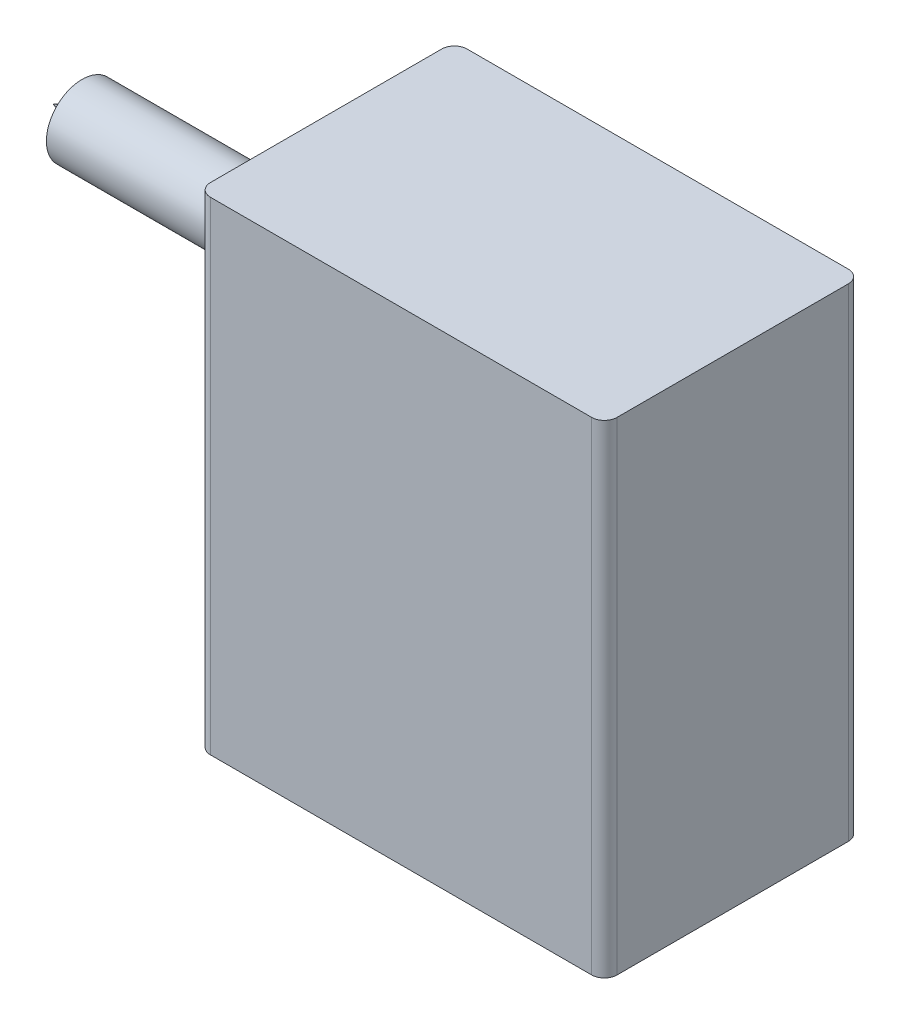
ISO-10303-21;
HEADER;
FILE_DESCRIPTION(('STEP AP214'),'2;1');
FILE_NAME('part.step','',(''),(''),'','','');
FILE_SCHEMA(('AUTOMOTIVE_DESIGN { 1 0 10303 214 1 1 1 1 }'));
ENDSEC;
DATA;
#1=APPLICATION_CONTEXT('core data for automotive mechanical design processes');
#2=APPLICATION_PROTOCOL_DEFINITION('international standard','automotive_design',2000,#1);
#3=PRODUCT_CONTEXT('',#1,'mechanical');
#4=PRODUCT('Part','Part','',(#3));
#5=PRODUCT_RELATED_PRODUCT_CATEGORY('part','',(#4));
#6=PRODUCT_DEFINITION_FORMATION('','',#4);
#7=PRODUCT_DEFINITION_CONTEXT('part definition',#1,'design');
#8=PRODUCT_DEFINITION('design','',#6,#7);
#9=PRODUCT_DEFINITION_SHAPE('','',#8);
#10=(LENGTH_UNIT() NAMED_UNIT(*) SI_UNIT(.MILLI.,.METRE.));
#11=(NAMED_UNIT(*) PLANE_ANGLE_UNIT() SI_UNIT($,.RADIAN.));
#12=(NAMED_UNIT(*) SI_UNIT($,.STERADIAN.) SOLID_ANGLE_UNIT());
#13=UNCERTAINTY_MEASURE_WITH_UNIT(LENGTH_MEASURE(1.E-05),#10,'distance_accuracy_value','');
#14=(GEOMETRIC_REPRESENTATION_CONTEXT(3) GLOBAL_UNCERTAINTY_ASSIGNED_CONTEXT((#13)) GLOBAL_UNIT_ASSIGNED_CONTEXT((#10,
#11,#12)) REPRESENTATION_CONTEXT('',''));
#15=CARTESIAN_POINT('',(0.,0.,0.));
#16=DIRECTION('',(0.,0.,1.));
#17=DIRECTION('',(1.,0.,0.));
#18=AXIS2_PLACEMENT_3D('',#15,#16,#17);
#19=CARTESIAN_POINT('',(340.509851846414,191.331636976959,202.));
#20=DIRECTION('',(-1.,0.,0.));
#21=DIRECTION('',(0.,0.,1.));
#22=AXIS2_PLACEMENT_3D('',#19,#20,#21);
#23=PLANE('',#22);
#24=DIRECTION('',(0.,0.,-1.));
#25=VECTOR('',#24,1.);
#26=CARTESIAN_POINT('',(340.509851846414,191.331636976959,202.));
#27=LINE('',#26,#25);
#28=CARTESIAN_POINT('',(340.509851846414,191.331636976959,192.));
#29=VERTEX_POINT('',#28);
#30=CARTESIAN_POINT('',(340.509851846414,191.331636976959,10.));
#31=VERTEX_POINT('',#30);
#32=EDGE_CURVE('E135',#29,#31,#27,.T.);
#33=ORIENTED_EDGE('',*,*,#32,.T.);
#34=DIRECTION('',(0.,1.,0.));
#35=VECTOR('',#34,1.);
#36=CARTESIAN_POINT('',(340.509851846414,191.331636976959,10.));
#37=LINE('',#36,#35);
#38=CARTESIAN_POINT('',(340.509851846414,571.331636976959,10.));
#39=VERTEX_POINT('',#38);
#40=EDGE_CURVE('E150',#31,#39,#37,.T.);
#41=ORIENTED_EDGE('',*,*,#40,.T.);
#42=DIRECTION('',(0.,0.,-1.));
#43=VECTOR('',#42,1.);
#44=CARTESIAN_POINT('',(340.509851846414,571.331636976959,202.));
#45=LINE('',#44,#43);
#46=CARTESIAN_POINT('',(340.509851846414,571.331636976959,192.));
#47=VERTEX_POINT('',#46);
#48=EDGE_CURVE('E127',#47,#39,#45,.T.);
#49=ORIENTED_EDGE('',*,*,#48,.F.);
#50=DIRECTION('',(0.,1.,0.));
#51=VECTOR('',#50,1.);
#52=CARTESIAN_POINT('',(340.509851846414,191.331636976959,192.));
#53=LINE('',#52,#51);
#54=EDGE_CURVE('E120',#47,#29,#53,.F.);
#55=ORIENTED_EDGE('',*,*,#54,.T.);
#56=EDGE_LOOP('',(#33,#41,#49,#55));
#57=FACE_BOUND('',#56,.T.);
#58=ADVANCED_FACE('F34',(#57),#23,.F.);
#59=CARTESIAN_POINT('',(340.509851846414,571.331636976959,202.));
#60=DIRECTION('',(0.,-1.,0.));
#61=DIRECTION('',(0.,0.,-1.));
#62=AXIS2_PLACEMENT_3D('',#59,#60,#61);
#63=PLANE('',#62);
#64=ORIENTED_EDGE('',*,*,#48,.T.);
#65=CARTESIAN_POINT('',(330.509851846414,571.331636976959,10.));
#66=DIRECTION('',(0.,-1.,0.));
#67=DIRECTION('',(0.,0.,-1.));
#68=AXIS2_PLACEMENT_3D('',#65,#66,#67);
#69=CIRCLE('',#68,10.);
#70=CARTESIAN_POINT('',(330.509851846414,571.331636976959,0.));
#71=VERTEX_POINT('',#70);
#72=EDGE_CURVE('E159',#39,#71,#69,.F.);
#73=ORIENTED_EDGE('',*,*,#72,.T.);
#74=DIRECTION('',(-1.,0.,0.));
#75=VECTOR('',#74,1.);
#76=CARTESIAN_POINT('',(340.509851846414,571.331636976959,0.));
#77=LINE('',#76,#75);
#78=CARTESIAN_POINT('',(30.509851846414,571.331636976959,0.));
#79=VERTEX_POINT('',#78);
#80=EDGE_CURVE('E124',#71,#79,#77,.T.);
#81=ORIENTED_EDGE('',*,*,#80,.T.);
#82=CARTESIAN_POINT('',(30.509851846414,571.331636976959,10.));
#83=DIRECTION('',(0.,-1.,0.));
#84=DIRECTION('',(0.,0.,-1.));
#85=AXIS2_PLACEMENT_3D('',#82,#83,#84);
#86=CIRCLE('',#85,10.);
#87=CARTESIAN_POINT('',(20.509851846414,571.331636976959,10.));
#88=VERTEX_POINT('',#87);
#89=EDGE_CURVE('E153',#79,#88,#86,.F.);
#90=ORIENTED_EDGE('',*,*,#89,.T.);
#91=DIRECTION('',(0.,0.,-1.));
#92=VECTOR('',#91,1.);
#93=CARTESIAN_POINT('',(20.509851846414,571.331636976959,202.));
#94=LINE('',#93,#92);
#95=CARTESIAN_POINT('',(20.509851846414,571.331636976959,192.));
#96=VERTEX_POINT('',#95);
#97=EDGE_CURVE('E144',#96,#88,#94,.T.);
#98=ORIENTED_EDGE('',*,*,#97,.F.);
#99=CARTESIAN_POINT('',(30.509851846414,571.331636976959,192.));
#100=DIRECTION('',(0.,-1.,0.));
#101=DIRECTION('',(0.,0.,-1.));
#102=AXIS2_PLACEMENT_3D('',#99,#100,#101);
#103=CIRCLE('',#102,10.);
#104=CARTESIAN_POINT('',(30.509851846414,571.331636976959,202.));
#105=VERTEX_POINT('',#104);
#106=EDGE_CURVE('E155',#96,#105,#103,.F.);
#107=ORIENTED_EDGE('',*,*,#106,.T.);
#108=DIRECTION('',(-1.,0.,0.));
#109=VECTOR('',#108,1.);
#110=CARTESIAN_POINT('',(340.509851846414,571.331636976959,202.));
#111=LINE('',#110,#109);
#112=CARTESIAN_POINT('',(330.509851846414,571.331636976959,202.));
#113=VERTEX_POINT('',#112);
#114=EDGE_CURVE('E128',#113,#105,#111,.T.);
#115=ORIENTED_EDGE('',*,*,#114,.F.);
#116=CARTESIAN_POINT('',(330.509851846414,571.331636976959,192.));
#117=DIRECTION('',(0.,-1.,0.));
#118=DIRECTION('',(0.,0.,-1.));
#119=AXIS2_PLACEMENT_3D('',#116,#117,#118);
#120=CIRCLE('',#119,10.);
#121=EDGE_CURVE('E157',#113,#47,#120,.F.);
#122=ORIENTED_EDGE('',*,*,#121,.T.);
#123=EDGE_LOOP('',(#64,#73,#81,#90,#98,#107,#115,#122));
#124=FACE_BOUND('',#123,.T.);
#125=ADVANCED_FACE('F189',(#124),#63,.F.);
#126=CARTESIAN_POINT('',(20.509851846414,571.331636976959,202.));
#127=DIRECTION('',(1.,0.,0.));
#128=DIRECTION('',(0.,1.,0.));
#129=AXIS2_PLACEMENT_3D('',#126,#127,#128);
#130=PLANE('',#129);
#131=CARTESIAN_POINT('',(20.509851846414,472.091168610263,101.));
#132=DIRECTION('',(-1.,0.,0.));
#133=DIRECTION('',(0.,-1.,0.));
#134=AXIS2_PLACEMENT_3D('',#131,#132,#133);
#135=CIRCLE('',#134,75.8204013998386);
#136=CARTESIAN_POINT('',(20.509851846414,396.270767210425,101.));
#137=VERTEX_POINT('',#136);
#138=EDGE_CURVE('E121',#137,#137,#135,.T.);
#139=ORIENTED_EDGE('',*,*,#138,.F.);
#140=EDGE_LOOP('',(#139));
#141=FACE_BOUND('',#140,.T.);
#142=DIRECTION('',(0.,0.,-1.));
#143=VECTOR('',#142,1.);
#144=CARTESIAN_POINT('',(20.5098518464141,191.331636976959,202.));
#145=LINE('',#144,#143);
#146=CARTESIAN_POINT('',(20.5098518464141,191.331636976959,192.));
#147=VERTEX_POINT('',#146);
#148=CARTESIAN_POINT('',(20.5098518464141,191.331636976959,10.));
#149=VERTEX_POINT('',#148);
#150=EDGE_CURVE('E142',#147,#149,#145,.T.);
#151=ORIENTED_EDGE('',*,*,#150,.F.);
#152=DIRECTION('',(0.,-1.,0.));
#153=VECTOR('',#152,1.);
#154=CARTESIAN_POINT('',(20.509851846414,571.331636976959,192.));
#155=LINE('',#154,#153);
#156=EDGE_CURVE('E11',#147,#96,#155,.F.);
#157=ORIENTED_EDGE('',*,*,#156,.T.);
#158=ORIENTED_EDGE('',*,*,#97,.T.);
#159=DIRECTION('',(0.,-1.,0.));
#160=VECTOR('',#159,1.);
#161=CARTESIAN_POINT('',(20.509851846414,571.331636976959,10.));
#162=LINE('',#161,#160);
#163=EDGE_CURVE('E42',#88,#149,#162,.T.);
#164=ORIENTED_EDGE('',*,*,#163,.T.);
#165=EDGE_LOOP('',(#151,#157,#158,#164));
#166=FACE_BOUND('',#165,.T.);
#167=ADVANCED_FACE('F177',(#141,#166),#130,.F.);
#168=CARTESIAN_POINT('',(20.5098518464141,191.331636976959,202.));
#169=DIRECTION('',(0.,1.,0.));
#170=DIRECTION('',(0.,0.,1.));
#171=AXIS2_PLACEMENT_3D('',#168,#169,#170);
#172=PLANE('',#171);
#173=DIRECTION('',(1.,0.,0.));
#174=VECTOR('',#173,1.);
#175=CARTESIAN_POINT('',(20.5098518464141,191.331636976959,0.));
#176=LINE('',#175,#174);
#177=CARTESIAN_POINT('',(30.5098518464141,191.331636976959,0.));
#178=VERTEX_POINT('',#177);
#179=CARTESIAN_POINT('',(330.509851846414,191.331636976959,0.));
#180=VERTEX_POINT('',#179);
#181=EDGE_CURVE('E132',#178,#180,#176,.T.);
#182=ORIENTED_EDGE('',*,*,#181,.T.);
#183=CARTESIAN_POINT('',(330.509851846414,191.331636976959,10.));
#184=DIRECTION('',(0.,1.,0.));
#185=DIRECTION('',(0.,0.,1.));
#186=AXIS2_PLACEMENT_3D('',#183,#184,#185);
#187=CIRCLE('',#186,10.);
#188=EDGE_CURVE('E169',#180,#31,#187,.F.);
#189=ORIENTED_EDGE('',*,*,#188,.T.);
#190=ORIENTED_EDGE('',*,*,#32,.F.);
#191=CARTESIAN_POINT('',(330.509851846414,191.331636976959,192.));
#192=DIRECTION('',(0.,1.,0.));
#193=DIRECTION('',(0.,0.,1.));
#194=AXIS2_PLACEMENT_3D('',#191,#192,#193);
#195=CIRCLE('',#194,10.);
#196=CARTESIAN_POINT('',(330.509851846414,191.331636976959,202.));
#197=VERTEX_POINT('',#196);
#198=EDGE_CURVE('E167',#29,#197,#195,.F.);
#199=ORIENTED_EDGE('',*,*,#198,.T.);
#200=DIRECTION('',(1.,0.,0.));
#201=VECTOR('',#200,1.);
#202=CARTESIAN_POINT('',(20.5098518464141,191.331636976959,202.));
#203=LINE('',#202,#201);
#204=CARTESIAN_POINT('',(30.5098518464141,191.331636976959,202.));
#205=VERTEX_POINT('',#204);
#206=EDGE_CURVE('E131',#205,#197,#203,.T.);
#207=ORIENTED_EDGE('',*,*,#206,.F.);
#208=CARTESIAN_POINT('',(30.5098518464141,191.331636976959,192.));
#209=DIRECTION('',(0.,1.,0.));
#210=DIRECTION('',(0.,0.,1.));
#211=AXIS2_PLACEMENT_3D('',#208,#209,#210);
#212=CIRCLE('',#211,10.);
#213=EDGE_CURVE('E57',#205,#147,#212,.F.);
#214=ORIENTED_EDGE('',*,*,#213,.T.);
#215=ORIENTED_EDGE('',*,*,#150,.T.);
#216=CARTESIAN_POINT('',(30.5098518464141,191.331636976959,10.));
#217=DIRECTION('',(0.,1.,0.));
#218=DIRECTION('',(0.,0.,1.));
#219=AXIS2_PLACEMENT_3D('',#216,#217,#218);
#220=CIRCLE('',#219,10.);
#221=EDGE_CURVE('E49',#149,#178,#220,.F.);
#222=ORIENTED_EDGE('',*,*,#221,.T.);
#223=EDGE_LOOP('',(#182,#189,#190,#199,#207,#214,#215,#222));
#224=FACE_BOUND('',#223,.T.);
#225=ADVANCED_FACE('F181',(#224),#172,.F.);
#226=CARTESIAN_POINT('',(0.,0.,202.));
#227=DIRECTION('',(0.,0.,1.));
#228=DIRECTION('',(1.,0.,0.));
#229=AXIS2_PLACEMENT_3D('',#226,#227,#228);
#230=PLANE('',#229);
#231=ORIENTED_EDGE('',*,*,#206,.T.);
#232=DIRECTION('',(0.,1.,0.));
#233=VECTOR('',#232,1.);
#234=CARTESIAN_POINT('',(330.509851846414,571.331636976959,202.));
#235=LINE('',#234,#233);
#236=EDGE_CURVE('E174',#197,#113,#235,.T.);
#237=ORIENTED_EDGE('',*,*,#236,.T.);
#238=ORIENTED_EDGE('',*,*,#114,.T.);
#239=DIRECTION('',(0.,-1.,0.));
#240=VECTOR('',#239,1.);
#241=CARTESIAN_POINT('',(30.5098518464141,191.331636976959,202.));
#242=LINE('',#241,#240);
#243=EDGE_CURVE('E171',#105,#205,#242,.T.);
#244=ORIENTED_EDGE('',*,*,#243,.T.);
#245=EDGE_LOOP('',(#231,#237,#238,#244));
#246=FACE_BOUND('',#245,.T.);
#247=ADVANCED_FACE('F202',(#246),#230,.T.);
#248=CARTESIAN_POINT('',(0.,0.,0.));
#249=DIRECTION('',(0.,0.,1.));
#250=DIRECTION('',(1.,0.,0.));
#251=AXIS2_PLACEMENT_3D('',#248,#249,#250);
#252=PLANE('',#251);
#253=ORIENTED_EDGE('',*,*,#80,.F.);
#254=DIRECTION('',(0.,1.,0.));
#255=VECTOR('',#254,1.);
#256=CARTESIAN_POINT('',(330.509851846414,0.,0.));
#257=LINE('',#256,#255);
#258=EDGE_CURVE('E163',#71,#180,#257,.F.);
#259=ORIENTED_EDGE('',*,*,#258,.T.);
#260=ORIENTED_EDGE('',*,*,#181,.F.);
#261=DIRECTION('',(0.,-1.,0.));
#262=VECTOR('',#261,1.);
#263=CARTESIAN_POINT('',(30.5098518464141,0.,0.));
#264=LINE('',#263,#262);
#265=EDGE_CURVE('E161',#178,#79,#264,.F.);
#266=ORIENTED_EDGE('',*,*,#265,.T.);
#267=EDGE_LOOP('',(#253,#259,#260,#266));
#268=FACE_BOUND('',#267,.T.);
#269=ADVANCED_FACE('F186',(#268),#252,.F.);
#270=CARTESIAN_POINT('',(4.50985184641403,472.091168610263,101.));
#271=DIRECTION('',(1.,0.,0.));
#272=DIRECTION('',(0.,1.,0.));
#273=AXIS2_PLACEMENT_3D('',#270,#271,#272);
#274=CYLINDRICAL_SURFACE('',#273,75.8204013998386);
#275=CARTESIAN_POINT('',(4.50985184641403,472.091168610263,101.));
#276=DIRECTION('',(-1.,0.,0.));
#277=DIRECTION('',(0.,-1.,0.));
#278=AXIS2_PLACEMENT_3D('',#275,#276,#277);
#279=CIRCLE('',#278,75.8204013998386);
#280=CARTESIAN_POINT('',(4.50985184641404,396.270767210425,101.));
#281=VERTEX_POINT('',#280);
#282=EDGE_CURVE('E114',#281,#281,#279,.T.);
#283=ORIENTED_EDGE('',*,*,#282,.F.);
#284=EDGE_LOOP('',(#283));
#285=FACE_BOUND('',#284,.T.);
#286=ORIENTED_EDGE('',*,*,#138,.T.);
#287=EDGE_LOOP('',(#286));
#288=FACE_BOUND('',#287,.T.);
#289=ADVANCED_FACE('F277',(#285,#288),#274,.T.);
#290=CARTESIAN_POINT('',(4.50985184641403,472.091168610263,101.));
#291=DIRECTION('',(-1.,0.,0.));
#292=DIRECTION('',(0.,-1.,0.));
#293=AXIS2_PLACEMENT_3D('',#290,#291,#292);
#294=PLANE('',#293);
#295=CARTESIAN_POINT('',(4.50985184641403,472.091168610263,101.));
#296=DIRECTION('',(-1.,0.,0.));
#297=DIRECTION('',(0.,-1.,0.));
#298=AXIS2_PLACEMENT_3D('',#295,#296,#297);
#299=CIRCLE('',#298,28.0511612718793);
#300=CARTESIAN_POINT('',(4.50985184641404,444.040007338384,101.));
#301=VERTEX_POINT('',#300);
#302=EDGE_CURVE('E117',#301,#301,#299,.T.);
#303=ORIENTED_EDGE('',*,*,#302,.F.);
#304=EDGE_LOOP('',(#303));
#305=FACE_BOUND('',#304,.T.);
#306=ORIENTED_EDGE('',*,*,#282,.T.);
#307=EDGE_LOOP('',(#306));
#308=FACE_BOUND('',#307,.T.);
#309=ADVANCED_FACE('F267',(#305,#308),#294,.T.);
#310=CARTESIAN_POINT('',(-171.490148153586,472.091168610263,101.));
#311=DIRECTION('',(1.,0.,0.));
#312=DIRECTION('',(0.,1.,0.));
#313=AXIS2_PLACEMENT_3D('',#310,#311,#312);
#314=CYLINDRICAL_SURFACE('',#313,28.0511612718793);
#315=CARTESIAN_POINT('',(-171.490148153586,472.091168610263,101.));
#316=DIRECTION('',(-1.,0.,0.));
#317=DIRECTION('',(0.,-1.,0.));
#318=AXIS2_PLACEMENT_3D('',#315,#316,#317);
#319=CIRCLE('',#318,28.0511612718793);
#320=CARTESIAN_POINT('',(-171.490148153586,444.040007338384,101.));
#321=VERTEX_POINT('',#320);
#322=EDGE_CURVE('E111',#321,#321,#319,.T.);
#323=ORIENTED_EDGE('',*,*,#322,.F.);
#324=EDGE_LOOP('',(#323));
#325=FACE_BOUND('',#324,.T.);
#326=ORIENTED_EDGE('',*,*,#302,.T.);
#327=EDGE_LOOP('',(#326));
#328=FACE_BOUND('',#327,.T.);
#329=ADVANCED_FACE('F258',(#325,#328),#314,.T.);
#330=CARTESIAN_POINT('',(-171.490148153586,472.091168610263,101.));
#331=DIRECTION('',(-1.,0.,0.));
#332=DIRECTION('',(0.,-1.,0.));
#333=AXIS2_PLACEMENT_3D('',#330,#331,#332);
#334=PLANE('',#333);
#335=CARTESIAN_POINT('',(-171.490148153586,472.091168610263,101.));
#336=DIRECTION('',(-1.,0.,0.));
#337=DIRECTION('',(0.,-1.,0.));
#338=AXIS2_PLACEMENT_3D('',#335,#336,#337);
#339=CIRCLE('',#338,8.31620659720254);
#340=CARTESIAN_POINT('',(-171.490148153586,463.774962013061,101.));
#341=VERTEX_POINT('',#340);
#342=EDGE_CURVE('E109',#341,#341,#339,.T.);
#343=ORIENTED_EDGE('',*,*,#342,.F.);
#344=EDGE_LOOP('',(#343));
#345=FACE_BOUND('',#344,.T.);
#346=ORIENTED_EDGE('',*,*,#322,.T.);
#347=EDGE_LOOP('',(#346));
#348=FACE_BOUND('',#347,.T.);
#349=ADVANCED_FACE('F105',(#345,#348),#334,.T.);
#350=CARTESIAN_POINT('',(-171.490148153586,472.091168610263,101.));
#351=DIRECTION('',(1.,0.,0.));
#352=DIRECTION('',(0.,-1.,0.));
#353=AXIS2_PLACEMENT_3D('',#350,#351,#352);
#354=CONICAL_SURFACE('',#353,8.31620659720254,0.349065850398866);
#355=CARTESIAN_POINT('',(-194.33873799492,472.091168610263,101.));
#356=VERTEX_POINT('',#355);
#357=VERTEX_LOOP('',#356);
#358=FACE_BOUND('',#357,.T.);
#359=ORIENTED_EDGE('',*,*,#342,.T.);
#360=EDGE_LOOP('',(#359));
#361=FACE_BOUND('',#360,.T.);
#362=ADVANCED_FACE('F101',(#358,#361),#354,.T.);
#363=CARTESIAN_POINT('',(330.509851846414,191.331636976959,10.));
#364=DIRECTION('',(0.,1.,0.));
#365=DIRECTION('',(0.,0.,1.));
#366=AXIS2_PLACEMENT_3D('',#363,#364,#365);
#367=CYLINDRICAL_SURFACE('',#366,10.);
#368=ORIENTED_EDGE('',*,*,#188,.F.);
#369=ORIENTED_EDGE('',*,*,#258,.F.);
#370=ORIENTED_EDGE('',*,*,#72,.F.);
#371=ORIENTED_EDGE('',*,*,#40,.F.);
#372=EDGE_LOOP('',(#368,#369,#370,#371));
#373=FACE_BOUND('',#372,.T.);
#374=ADVANCED_FACE('F104',(#373),#367,.T.);
#375=CARTESIAN_POINT('',(330.509851846414,0.,192.));
#376=DIRECTION('',(0.,-1.,0.));
#377=DIRECTION('',(0.,0.,-1.));
#378=AXIS2_PLACEMENT_3D('',#375,#376,#377);
#379=CYLINDRICAL_SURFACE('',#378,10.);
#380=ORIENTED_EDGE('',*,*,#198,.F.);
#381=ORIENTED_EDGE('',*,*,#54,.F.);
#382=ORIENTED_EDGE('',*,*,#121,.F.);
#383=ORIENTED_EDGE('',*,*,#236,.F.);
#384=EDGE_LOOP('',(#380,#381,#382,#383));
#385=FACE_BOUND('',#384,.T.);
#386=ADVANCED_FACE('F199',(#385),#379,.T.);
#387=CARTESIAN_POINT('',(30.5098518464141,0.,192.));
#388=DIRECTION('',(0.,1.,0.));
#389=DIRECTION('',(-1.,0.,0.));
#390=AXIS2_PLACEMENT_3D('',#387,#388,#389);
#391=CYLINDRICAL_SURFACE('',#390,10.);
#392=ORIENTED_EDGE('',*,*,#106,.F.);
#393=ORIENTED_EDGE('',*,*,#156,.F.);
#394=ORIENTED_EDGE('',*,*,#213,.F.);
#395=ORIENTED_EDGE('',*,*,#243,.F.);
#396=EDGE_LOOP('',(#392,#393,#394,#395));
#397=FACE_BOUND('',#396,.T.);
#398=ADVANCED_FACE('F206',(#397),#391,.T.);
#399=CARTESIAN_POINT('',(30.509851846414,571.331636976959,10.));
#400=DIRECTION('',(0.,-1.,0.));
#401=DIRECTION('',(1.,0.,0.));
#402=AXIS2_PLACEMENT_3D('',#399,#400,#401);
#403=CYLINDRICAL_SURFACE('',#402,10.);
#404=ORIENTED_EDGE('',*,*,#89,.F.);
#405=ORIENTED_EDGE('',*,*,#265,.F.);
#406=ORIENTED_EDGE('',*,*,#221,.F.);
#407=ORIENTED_EDGE('',*,*,#163,.F.);
#408=EDGE_LOOP('',(#404,#405,#406,#407));
#409=FACE_BOUND('',#408,.T.);
#410=ADVANCED_FACE('F36',(#409),#403,.T.);
#411=CLOSED_SHELL('',(#58,#125,#167,#225,#247,#269,#289,#309,#329,#349,#362,#374,#386,#398,#410));
#412=MANIFOLD_SOLID_BREP('B2',#411);
#413=ADVANCED_BREP_SHAPE_REPRESENTATION('',(#18,#412),#14);
#414=SHAPE_DEFINITION_REPRESENTATION(#9,#413);
ENDSEC;
END-ISO-10303-21;
